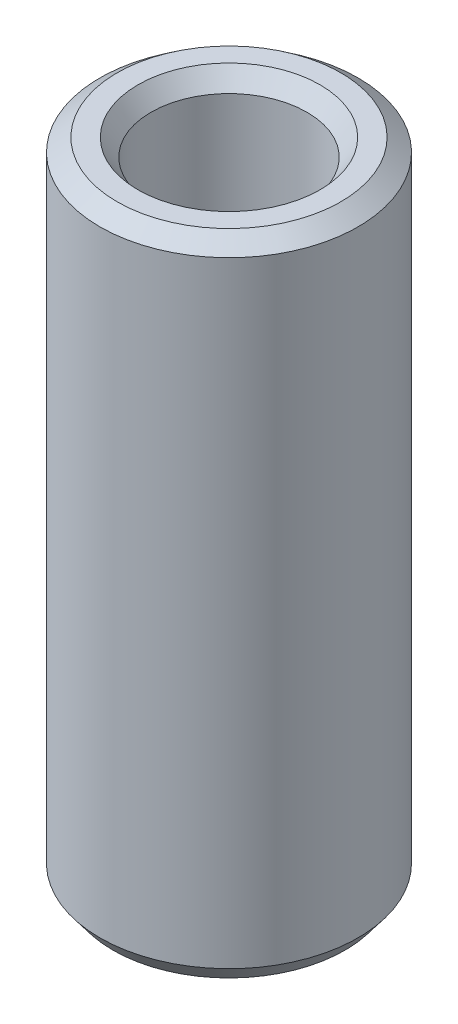
ISO-10303-21;
HEADER;
FILE_DESCRIPTION(('STEP AP214'),'2;1');
FILE_NAME('part.step','',(''),(''),'','','');
FILE_SCHEMA(('AUTOMOTIVE_DESIGN { 1 0 10303 214 1 1 1 1 }'));
ENDSEC;
DATA;
#1=APPLICATION_CONTEXT('core data for automotive mechanical design processes');
#2=APPLICATION_PROTOCOL_DEFINITION('international standard','automotive_design',2000,#1);
#3=PRODUCT_CONTEXT('',#1,'mechanical');
#4=PRODUCT('Part','Part','',(#3));
#5=PRODUCT_RELATED_PRODUCT_CATEGORY('part','',(#4));
#6=PRODUCT_DEFINITION_FORMATION('','',#4);
#7=PRODUCT_DEFINITION_CONTEXT('part definition',#1,'design');
#8=PRODUCT_DEFINITION('design','',#6,#7);
#9=PRODUCT_DEFINITION_SHAPE('','',#8);
#10=(LENGTH_UNIT() NAMED_UNIT(*) SI_UNIT(.MILLI.,.METRE.));
#11=(NAMED_UNIT(*) PLANE_ANGLE_UNIT() SI_UNIT($,.RADIAN.));
#12=(NAMED_UNIT(*) SI_UNIT($,.STERADIAN.) SOLID_ANGLE_UNIT());
#13=UNCERTAINTY_MEASURE_WITH_UNIT(LENGTH_MEASURE(1.E-05),#10,'distance_accuracy_value','');
#14=(GEOMETRIC_REPRESENTATION_CONTEXT(3) GLOBAL_UNCERTAINTY_ASSIGNED_CONTEXT((#13)) GLOBAL_UNIT_ASSIGNED_CONTEXT((#10,
#11,#12)) REPRESENTATION_CONTEXT('',''));
#15=CARTESIAN_POINT('',(0.,0.,0.));
#16=DIRECTION('',(0.,0.,1.));
#17=DIRECTION('',(1.,0.,0.));
#18=AXIS2_PLACEMENT_3D('',#15,#16,#17);
#19=CARTESIAN_POINT('',(0.,150.156553335183,0.));
#20=DIRECTION('',(0.,-1.,0.));
#21=DIRECTION('',(0.,0.,-1.));
#22=AXIS2_PLACEMENT_3D('',#19,#20,#21);
#23=CYLINDRICAL_SURFACE('',#22,30.);
#24=CARTESIAN_POINT('',(0.,4.01205874063631,0.));
#25=DIRECTION('',(0.,1.,0.));
#26=DIRECTION('',(0.,0.,1.));
#27=AXIS2_PLACEMENT_3D('',#24,#25,#26);
#28=CIRCLE('',#27,30.);
#29=CARTESIAN_POINT('',(0.,4.01205874063631,30.));
#30=VERTEX_POINT('',#29);
#31=EDGE_CURVE('E10',#30,#30,#28,.T.);
#32=ORIENTED_EDGE('',*,*,#31,.T.);
#33=EDGE_LOOP('',(#32));
#34=FACE_BOUND('',#33,.T.);
#35=CARTESIAN_POINT('',(0.,147.124484560532,0.));
#36=DIRECTION('',(0.,1.,0.));
#37=DIRECTION('',(0.,0.,1.));
#38=AXIS2_PLACEMENT_3D('',#35,#36,#37);
#39=CIRCLE('',#38,30.);
#40=CARTESIAN_POINT('',(0.,147.124484560532,30.));
#41=VERTEX_POINT('',#40);
#42=EDGE_CURVE('E50',#41,#41,#39,.F.);
#43=ORIENTED_EDGE('',*,*,#42,.T.);
#44=EDGE_LOOP('',(#43));
#45=FACE_BOUND('',#44,.T.);
#46=ADVANCED_FACE('F39',(#34,#45),#23,.T.);
#47=CARTESIAN_POINT('',(0.,150.156553335183,0.));
#48=DIRECTION('',(0.,1.,0.));
#49=DIRECTION('',(0.,0.,1.));
#50=AXIS2_PLACEMENT_3D('',#47,#48,#49);
#51=PLANE('',#50);
#52=CARTESIAN_POINT('',(0.,150.156553335183,0.));
#53=DIRECTION('',(0.,1.,0.));
#54=DIRECTION('',(0.,0.,1.));
#55=AXIS2_PLACEMENT_3D('',#52,#53,#54);
#56=CIRCLE('',#55,21.1560973623406);
#57=CARTESIAN_POINT('',(0.,150.156553335183,21.1560973623406));
#58=VERTEX_POINT('',#57);
#59=EDGE_CURVE('E58',#58,#58,#56,.F.);
#60=ORIENTED_EDGE('',*,*,#59,.T.);
#61=EDGE_LOOP('',(#60));
#62=FACE_BOUND('',#61,.T.);
#63=CARTESIAN_POINT('',(0.,150.156553335183,0.));
#64=DIRECTION('',(0.,1.,0.));
#65=DIRECTION('',(0.,0.,1.));
#66=AXIS2_PLACEMENT_3D('',#63,#64,#65);
#67=CIRCLE('',#66,25.9879412593637);
#68=CARTESIAN_POINT('',(0.,150.156553335183,25.9879412593637));
#69=VERTEX_POINT('',#68);
#70=EDGE_CURVE('E61',#69,#69,#67,.T.);
#71=ORIENTED_EDGE('',*,*,#70,.T.);
#72=EDGE_LOOP('',(#71));
#73=FACE_BOUND('',#72,.T.);
#74=ADVANCED_FACE('F88',(#62,#73),#51,.T.);
#75=CARTESIAN_POINT('',(0.,0.,0.));
#76=DIRECTION('',(0.,1.,0.));
#77=DIRECTION('',(0.,0.,1.));
#78=AXIS2_PLACEMENT_3D('',#75,#76,#77);
#79=PLANE('',#78);
#80=CARTESIAN_POINT('',(0.,0.,0.));
#81=DIRECTION('',(0.,1.,0.));
#82=DIRECTION('',(0.,0.,1.));
#83=AXIS2_PLACEMENT_3D('',#80,#81,#82);
#84=CIRCLE('',#83,22.1360873283256);
#85=CARTESIAN_POINT('',(0.,0.,-22.1360873283256));
#86=VERTEX_POINT('',#85);
#87=EDGE_CURVE('E51',#86,#86,#84,.T.);
#88=ORIENTED_EDGE('',*,*,#87,.T.);
#89=EDGE_LOOP('',(#88));
#90=FACE_BOUND('',#89,.T.);
#91=CARTESIAN_POINT('',(0.,0.,0.));
#92=DIRECTION('',(0.,1.,0.));
#93=DIRECTION('',(0.,0.,1.));
#94=AXIS2_PLACEMENT_3D('',#91,#92,#93);
#95=CIRCLE('',#94,26.9679312253486);
#96=CARTESIAN_POINT('',(0.,0.,26.9679312253486));
#97=VERTEX_POINT('',#96);
#98=EDGE_CURVE('E54',#97,#97,#95,.F.);
#99=ORIENTED_EDGE('',*,*,#98,.T.);
#100=EDGE_LOOP('',(#99));
#101=FACE_BOUND('',#100,.T.);
#102=ADVANCED_FACE('F83',(#90,#101),#79,.F.);
#103=CARTESIAN_POINT('',(0.,150.156553335183,0.));
#104=DIRECTION('',(0.,-1.,0.));
#105=DIRECTION('',(0.,0.,-1.));
#106=AXIS2_PLACEMENT_3D('',#103,#104,#105);
#107=CYLINDRICAL_SURFACE('',#106,18.1240285876893);
#108=CARTESIAN_POINT('',(0.,146.144494594547,0.));
#109=DIRECTION('',(0.,1.,0.));
#110=DIRECTION('',(0.,0.,1.));
#111=AXIS2_PLACEMENT_3D('',#108,#109,#110);
#112=CIRCLE('',#111,18.1240285876893);
#113=CARTESIAN_POINT('',(0.,146.144494594547,18.1240285876893));
#114=VERTEX_POINT('',#113);
#115=EDGE_CURVE('E67',#114,#114,#112,.T.);
#116=ORIENTED_EDGE('',*,*,#115,.T.);
#117=EDGE_LOOP('',(#116));
#118=FACE_BOUND('',#117,.T.);
#119=CARTESIAN_POINT('',(0.,3.03206877465134,0.));
#120=DIRECTION('',(0.,1.,0.));
#121=DIRECTION('',(0.,0.,1.));
#122=AXIS2_PLACEMENT_3D('',#119,#120,#121);
#123=CIRCLE('',#122,18.1240285876893);
#124=CARTESIAN_POINT('',(0.,3.03206877465134,-18.1240285876893));
#125=VERTEX_POINT('',#124);
#126=EDGE_CURVE('E69',#125,#125,#123,.F.);
#127=ORIENTED_EDGE('',*,*,#126,.T.);
#128=EDGE_LOOP('',(#127));
#129=FACE_BOUND('',#128,.T.);
#130=ADVANCED_FACE('F71',(#118,#129),#107,.F.);
#131=CARTESIAN_POINT('',(0.,146.144494594547,0.));
#132=DIRECTION('',(0.,1.,0.));
#133=DIRECTION('',(0.,0.,1.));
#134=AXIS2_PLACEMENT_3D('',#131,#132,#133);
#135=CONICAL_SURFACE('',#134,18.1240285876893,0.64716388514145);
#136=ORIENTED_EDGE('',*,*,#59,.F.);
#137=EDGE_LOOP('',(#136));
#138=FACE_BOUND('',#137,.T.);
#139=ORIENTED_EDGE('',*,*,#115,.F.);
#140=EDGE_LOOP('',(#139));
#141=FACE_BOUND('',#140,.T.);
#142=ADVANCED_FACE('F77',(#138,#141),#135,.F.);
#143=CARTESIAN_POINT('',(0.,0.,0.));
#144=DIRECTION('',(0.,-1.,0.));
#145=DIRECTION('',(0.,0.,-1.));
#146=AXIS2_PLACEMENT_3D('',#143,#144,#145);
#147=CONICAL_SURFACE('',#146,22.1360873283256,0.923632441653445);
#148=CARTESIAN_POINT('',(0.,3.03206877465134,-18.1240285876893));
#149=CARTESIAN_POINT('',(0.,3.00048472491539,-18.1658208662376));
#150=CARTESIAN_POINT('',(0.,2.96890067517944,-18.2076131447859));
#151=CARTESIAN_POINT('',(0.,2.90573257570754,-18.2911977018825));
#152=CARTESIAN_POINT('',(0.,2.87414852597158,-18.3329899804308));
#153=CARTESIAN_POINT('',(0.,2.81098042649968,-18.4165745375274));
#154=CARTESIAN_POINT('',(0.,2.77939637676373,-18.4583668160757));
#155=CARTESIAN_POINT('',(0.,2.71622827729183,-18.5419513731723));
#156=CARTESIAN_POINT('',(0.,2.68464422755588,-18.5837436517206));
#157=CARTESIAN_POINT('',(0.,2.62147612808397,-18.6673282088172));
#158=CARTESIAN_POINT('',(0.,2.58989207834802,-18.7091204873654));
#159=CARTESIAN_POINT('',(0.,2.52672397887612,-18.792705044462));
#160=CARTESIAN_POINT('',(0.,2.49513992914017,-18.8344973230103));
#161=CARTESIAN_POINT('',(0.,2.43197182966826,-18.9180818801069));
#162=CARTESIAN_POINT('',(0.,2.40038777993231,-18.9598741586552));
#163=CARTESIAN_POINT('',(0.,2.33721968046041,-19.0434587157518));
#164=CARTESIAN_POINT('',(0.,2.30563563072446,-19.0852509943001));
#165=CARTESIAN_POINT('',(0.,2.24246753125255,-19.1688355513967));
#166=CARTESIAN_POINT('',(0.,2.2108834815166,-19.210627829945));
#167=CARTESIAN_POINT('',(0.,2.1477153820447,-19.2942123870416));
#168=CARTESIAN_POINT('',(0.,2.11613133230875,-19.3360046655899));
#169=CARTESIAN_POINT('',(0.,2.05296323283685,-19.4195892226865));
#170=CARTESIAN_POINT('',(0.,2.02137918310089,-19.4613815012348));
#171=CARTESIAN_POINT('',(0.,1.95821108362899,-19.5449660583313));
#172=CARTESIAN_POINT('',(0.,1.92662703389304,-19.5867583368796));
#173=CARTESIAN_POINT('',(0.,1.86345893442114,-19.6703428939762));
#174=CARTESIAN_POINT('',(0.,1.83187488468519,-19.7121351725245));
#175=CARTESIAN_POINT('',(0.,1.76870678521328,-19.7957197296211));
#176=CARTESIAN_POINT('',(0.,1.73712273547733,-19.8375120081694));
#177=CARTESIAN_POINT('',(0.,1.67395463600543,-19.921096565266));
#178=CARTESIAN_POINT('',(0.,1.64237058626948,-19.9628888438143));
#179=CARTESIAN_POINT('',(0.,1.57920248679757,-20.0464734009109));
#180=CARTESIAN_POINT('',(0.,1.54761843706162,-20.0882656794592));
#181=CARTESIAN_POINT('',(0.,1.48445033758972,-20.1718502365558));
#182=CARTESIAN_POINT('',(0.,1.45286628785377,-20.2136425151041));
#183=CARTESIAN_POINT('',(0.,1.38969818838186,-20.2972270722006));
#184=CARTESIAN_POINT('',(0.,1.35811413864591,-20.3390193507489));
#185=CARTESIAN_POINT('',(0.,1.29494603917401,-20.4226039078455));
#186=CARTESIAN_POINT('',(0.,1.26336198943806,-20.4643961863938));
#187=CARTESIAN_POINT('',(0.,1.20019388996616,-20.5479807434904));
#188=CARTESIAN_POINT('',(0.,1.1686098402302,-20.5897730220387));
#189=CARTESIAN_POINT('',(0.,1.1054417407583,-20.6733575791353));
#190=CARTESIAN_POINT('',(0.,1.07385769102235,-20.7151498576836));
#191=CARTESIAN_POINT('',(0.,1.01068959155045,-20.7987344147802));
#192=CARTESIAN_POINT('',(0.,0.979105541814496,-20.8405266933285));
#193=CARTESIAN_POINT('',(0.,0.915937442342593,-20.9241112504251));
#194=CARTESIAN_POINT('',(0.,0.884353392606641,-20.9659035289734));
#195=CARTESIAN_POINT('',(0.,0.821185293134738,-21.04948808607));
#196=CARTESIAN_POINT('',(0.,0.789601243398787,-21.0912803646182));
#197=CARTESIAN_POINT('',(0.,0.726433143926884,-21.1748649217148));
#198=CARTESIAN_POINT('',(0.,0.694849094190933,-21.2166572002631));
#199=CARTESIAN_POINT('',(0.,0.631680994719029,-21.3002417573597));
#200=CARTESIAN_POINT('',(0.,0.600096944983078,-21.342034035908));
#201=CARTESIAN_POINT('',(0.,0.536928845511175,-21.4256185930046));
#202=CARTESIAN_POINT('',(0.,0.505344795775224,-21.4674108715529));
#203=CARTESIAN_POINT('',(0.,0.442176696303321,-21.5509954286495));
#204=CARTESIAN_POINT('',(0.,0.410592646567369,-21.5927877071978));
#205=CARTESIAN_POINT('',(0.,0.347424547095466,-21.6763722642944));
#206=CARTESIAN_POINT('',(0.,0.315840497359515,-21.7181645428427));
#207=CARTESIAN_POINT('',(0.,0.252672397887612,-21.8017490999393));
#208=CARTESIAN_POINT('',(0.,0.22108834815166,-21.8435413784876));
#209=CARTESIAN_POINT('',(0.,0.157920248679757,-21.9271259355841));
#210=CARTESIAN_POINT('',(0.,0.126336198943806,-21.9689182141324));
#211=CARTESIAN_POINT('',(0.,0.0631680994719035,-22.052502771229));
#212=CARTESIAN_POINT('',(0.,0.0315840497359522,-22.0942950497773));
#213=CARTESIAN_POINT('',(0.,0.,-22.1360873283256));
#214=B_SPLINE_CURVE_WITH_KNOTS('',3,(#148,#149,#150,#151,#152,#153,#154,#155,#156,#157,#158,
#159,#160,#161,#162,#163,#164,#165,#166,#167,#168,#169,#170,#171,#172,#173,#174,#175,#176,#177,
#178,#179,#180,#181,#182,#183,#184,#185,#186,#187,#188,#189,#190,#191,#192,#193,#194,#195,#196,
#197,#198,#199,#200,#201,#202,#203,#204,#205,#206,#207,#208,#209,#210,#211,#212,#213),
.UNSPECIFIED.,.F.,.F.,(4,2,2,2,2,2,2,2,2,2,2,2,2,2,2,2,2,2,2,2,2,2,2,2,2,2,2,2,2,2,2,2,4),(0.,
0.157153812221758,0.314307624443519,0.471461436665276,0.628615248887034,0.785769061108792,
0.942922873330553,1.10007668555231,1.25723049777407,1.41438430999583,1.57153812221759,
1.72869193443935,1.8858457466611,2.04299955888286,2.20015337110462,2.35730718332638,
2.51446099554814,2.6716148077699,2.82876861999166,2.98592243221341,3.14307624443517,
3.30023005665693,3.45738386887869,3.61453768110045,3.77169149332221,3.92884530554397,
4.08599911776572,4.24315292998748,4.40030674220924,4.557460554431,4.71461436665276,
4.87176817887452,5.02892199109628),.UNSPECIFIED.);
#215=EDGE_CURVE('BSEAM73',#125,#86,#214,.T.);
#216=ORIENTED_EDGE('',*,*,#126,.F.);
#217=ORIENTED_EDGE('',*,*,#87,.F.);
#218=ORIENTED_EDGE('',*,*,#215,.T.);
#219=ORIENTED_EDGE('',*,*,#215,.F.);
#220=EDGE_LOOP('',(#216,#218,#217,#219));
#221=FACE_BOUND('',#220,.T.);
#222=ADVANCED_FACE('F73',(#221),#147,.F.);
#223=CARTESIAN_POINT('',(0.,4.01205874063631,0.));
#224=DIRECTION('',(0.,1.,0.));
#225=DIRECTION('',(0.,0.,1.));
#226=AXIS2_PLACEMENT_3D('',#223,#224,#225);
#227=CONICAL_SURFACE('',#226,30.,0.647163885141456);
#228=ORIENTED_EDGE('',*,*,#98,.F.);
#229=EDGE_LOOP('',(#228));
#230=FACE_BOUND('',#229,.T.);
#231=ORIENTED_EDGE('',*,*,#31,.F.);
#232=EDGE_LOOP('',(#231));
#233=FACE_BOUND('',#232,.T.);
#234=ADVANCED_FACE('F76',(#230,#233),#227,.T.);
#235=CARTESIAN_POINT('',(0.,150.156553335183,0.));
#236=DIRECTION('',(0.,-1.,0.));
#237=DIRECTION('',(0.,0.,-1.));
#238=AXIS2_PLACEMENT_3D('',#235,#236,#237);
#239=CONICAL_SURFACE('',#238,25.9879412593637,0.923632441653446);
#240=ORIENTED_EDGE('',*,*,#42,.F.);
#241=EDGE_LOOP('',(#240));
#242=FACE_BOUND('',#241,.T.);
#243=ORIENTED_EDGE('',*,*,#70,.F.);
#244=EDGE_LOOP('',(#243));
#245=FACE_BOUND('',#244,.T.);
#246=ADVANCED_FACE('F45',(#242,#245),#239,.T.);
#247=CLOSED_SHELL('',(#46,#74,#102,#130,#142,#222,#234,#246));
#248=MANIFOLD_SOLID_BREP('B2',#247);
#249=ADVANCED_BREP_SHAPE_REPRESENTATION('',(#18,#248),#14);
#250=SHAPE_DEFINITION_REPRESENTATION(#9,#249);
ENDSEC;
END-ISO-10303-21;
